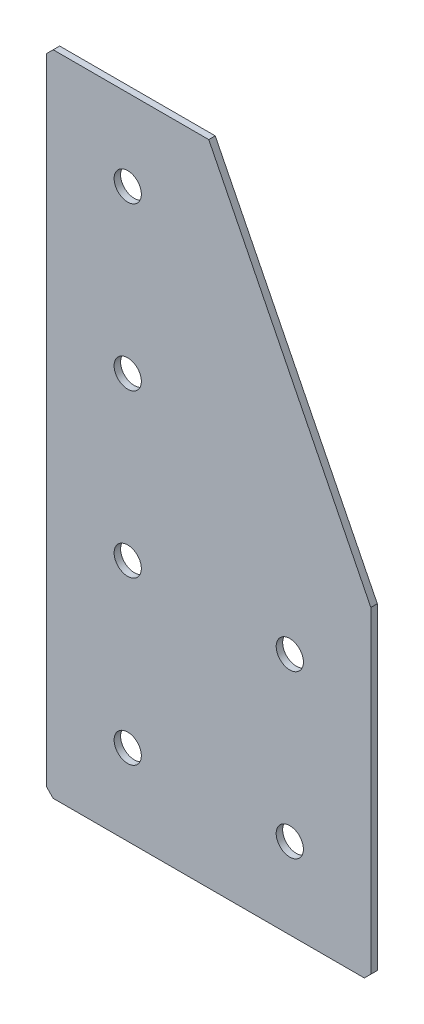
ISO-10303-21;
HEADER;
FILE_DESCRIPTION(('STEP AP214'),'2;1');
FILE_NAME('part.step','',(''),(''),'','','');
FILE_SCHEMA(('AUTOMOTIVE_DESIGN { 1 0 10303 214 1 1 1 1 }'));
ENDSEC;
DATA;
#1=APPLICATION_CONTEXT('core data for automotive mechanical design processes');
#2=APPLICATION_PROTOCOL_DEFINITION('international standard','automotive_design',2000,#1);
#3=PRODUCT_CONTEXT('',#1,'mechanical');
#4=PRODUCT('Part','Part','',(#3));
#5=PRODUCT_RELATED_PRODUCT_CATEGORY('part','',(#4));
#6=PRODUCT_DEFINITION_FORMATION('','',#4);
#7=PRODUCT_DEFINITION_CONTEXT('part definition',#1,'design');
#8=PRODUCT_DEFINITION('design','',#6,#7);
#9=PRODUCT_DEFINITION_SHAPE('','',#8);
#10=(LENGTH_UNIT() NAMED_UNIT(*) SI_UNIT(.MILLI.,.METRE.));
#11=(NAMED_UNIT(*) PLANE_ANGLE_UNIT() SI_UNIT($,.RADIAN.));
#12=(NAMED_UNIT(*) SI_UNIT($,.STERADIAN.) SOLID_ANGLE_UNIT());
#13=UNCERTAINTY_MEASURE_WITH_UNIT(LENGTH_MEASURE(1.E-05),#10,'distance_accuracy_value','');
#14=(GEOMETRIC_REPRESENTATION_CONTEXT(3) GLOBAL_UNCERTAINTY_ASSIGNED_CONTEXT((#13)) GLOBAL_UNIT_ASSIGNED_CONTEXT((#10,
#11,#12)) REPRESENTATION_CONTEXT('',''));
#15=CARTESIAN_POINT('',(0.,0.,0.));
#16=DIRECTION('',(0.,0.,1.));
#17=DIRECTION('',(1.,0.,0.));
#18=AXIS2_PLACEMENT_3D('',#15,#16,#17);
#19=CARTESIAN_POINT('',(0.,0.,-2.));
#20=DIRECTION('',(0.,0.,1.));
#21=DIRECTION('',(1.,0.,0.));
#22=AXIS2_PLACEMENT_3D('',#19,#20,#21);
#23=PLANE('',#22);
#24=CARTESIAN_POINT('',(25.,-175.,-2.00000000000001));
#25=DIRECTION('',(0.,0.,-1.));
#26=DIRECTION('',(0.,1.,0.));
#27=AXIS2_PLACEMENT_3D('',#24,#25,#26);
#28=CIRCLE('',#27,4.2);
#29=CARTESIAN_POINT('',(25.,-170.8,-2.00000000000001));
#30=VERTEX_POINT('',#29);
#31=EDGE_CURVE('E243',#30,#30,#28,.T.);
#32=ORIENTED_EDGE('',*,*,#31,.F.);
#33=EDGE_LOOP('',(#32));
#34=FACE_BOUND('',#33,.T.);
#35=CARTESIAN_POINT('',(25.,-125.,-2.00000000000001));
#36=DIRECTION('',(0.,0.,-1.));
#37=DIRECTION('',(0.,1.,0.));
#38=AXIS2_PLACEMENT_3D('',#35,#36,#37);
#39=CIRCLE('',#38,4.2);
#40=CARTESIAN_POINT('',(25.,-120.8,-2.00000000000001));
#41=VERTEX_POINT('',#40);
#42=EDGE_CURVE('E235',#41,#41,#39,.T.);
#43=ORIENTED_EDGE('',*,*,#42,.F.);
#44=EDGE_LOOP('',(#43));
#45=FACE_BOUND('',#44,.T.);
#46=CARTESIAN_POINT('',(25.,-25.,-2.));
#47=DIRECTION('',(0.,0.,-1.));
#48=DIRECTION('',(0.,1.,0.));
#49=AXIS2_PLACEMENT_3D('',#46,#47,#48);
#50=CIRCLE('',#49,4.2);
#51=CARTESIAN_POINT('',(25.,-20.8,-2.));
#52=VERTEX_POINT('',#51);
#53=EDGE_CURVE('E219',#52,#52,#50,.T.);
#54=ORIENTED_EDGE('',*,*,#53,.F.);
#55=EDGE_LOOP('',(#54));
#56=FACE_BOUND('',#55,.T.);
#57=CARTESIAN_POINT('',(75.,-175.,-2.00000000000001));
#58=DIRECTION('',(0.,0.,-1.));
#59=DIRECTION('',(0.,1.,0.));
#60=AXIS2_PLACEMENT_3D('',#57,#58,#59);
#61=CIRCLE('',#60,4.2);
#62=CARTESIAN_POINT('',(75.,-170.8,-2.00000000000001));
#63=VERTEX_POINT('',#62);
#64=EDGE_CURVE('E211',#63,#63,#61,.T.);
#65=ORIENTED_EDGE('',*,*,#64,.F.);
#66=EDGE_LOOP('',(#65));
#67=FACE_BOUND('',#66,.T.);
#68=CARTESIAN_POINT('',(75.,-125.,-2.00000000000001));
#69=DIRECTION('',(0.,0.,-1.));
#70=DIRECTION('',(0.,1.,0.));
#71=AXIS2_PLACEMENT_3D('',#68,#69,#70);
#72=CIRCLE('',#71,4.2);
#73=CARTESIAN_POINT('',(75.,-120.8,-2.00000000000001));
#74=VERTEX_POINT('',#73);
#75=EDGE_CURVE('E203',#74,#74,#72,.T.);
#76=ORIENTED_EDGE('',*,*,#75,.F.);
#77=EDGE_LOOP('',(#76));
#78=FACE_BOUND('',#77,.T.);
#79=DIRECTION('',(0.,1.,0.));
#80=VECTOR('',#79,1.);
#81=CARTESIAN_POINT('',(0.,0.,-2.));
#82=LINE('',#81,#80);
#83=CARTESIAN_POINT('',(0.,-198.,-2.));
#84=VERTEX_POINT('',#83);
#85=CARTESIAN_POINT('',(0.,-2.,-2.));
#86=VERTEX_POINT('',#85);
#87=EDGE_CURVE('E140',#84,#86,#82,.T.);
#88=ORIENTED_EDGE('',*,*,#87,.T.);
#89=DIRECTION('',(-0.707106781186548,-0.707106781186548,0.));
#90=VECTOR('',#89,1.);
#91=CARTESIAN_POINT('',(2.,0.,-2.));
#92=LINE('',#91,#90);
#93=CARTESIAN_POINT('',(2.,0.,-2.));
#94=VERTEX_POINT('',#93);
#95=EDGE_CURVE('E111',#86,#94,#92,.F.);
#96=ORIENTED_EDGE('',*,*,#95,.T.);
#97=DIRECTION('',(1.,0.,0.));
#98=VECTOR('',#97,1.);
#99=CARTESIAN_POINT('',(50.,0.,-2.));
#100=LINE('',#99,#98);
#101=CARTESIAN_POINT('',(50.,0.,-2.));
#102=VERTEX_POINT('',#101);
#103=EDGE_CURVE('E104',#94,#102,#100,.T.);
#104=ORIENTED_EDGE('',*,*,#103,.T.);
#105=DIRECTION('',(0.447213595499958,-0.894427190999916,0.));
#106=VECTOR('',#105,1.);
#107=CARTESIAN_POINT('',(100.,-100.,-2.));
#108=LINE('',#107,#106);
#109=CARTESIAN_POINT('',(100.,-100.,-2.));
#110=VERTEX_POINT('',#109);
#111=EDGE_CURVE('E108',#102,#110,#108,.T.);
#112=ORIENTED_EDGE('',*,*,#111,.T.);
#113=DIRECTION('',(0.,-1.,0.));
#114=VECTOR('',#113,1.);
#115=CARTESIAN_POINT('',(100.,-200.,-2.));
#116=LINE('',#115,#114);
#117=CARTESIAN_POINT('',(100.,-198.,-2.));
#118=VERTEX_POINT('',#117);
#119=EDGE_CURVE('E127',#110,#118,#116,.T.);
#120=ORIENTED_EDGE('',*,*,#119,.T.);
#121=DIRECTION('',(0.707106781186548,0.707106781186548,0.));
#122=VECTOR('',#121,1.);
#123=CARTESIAN_POINT('',(97.9999999999999,-200.,-2.));
#124=LINE('',#123,#122);
#125=CARTESIAN_POINT('',(97.9999999999999,-200.,-2.));
#126=VERTEX_POINT('',#125);
#127=EDGE_CURVE('E62',#118,#126,#124,.F.);
#128=ORIENTED_EDGE('',*,*,#127,.T.);
#129=DIRECTION('',(-1.,0.,0.));
#130=VECTOR('',#129,1.);
#131=CARTESIAN_POINT('',(0.,-200.,-2.));
#132=LINE('',#131,#130);
#133=CARTESIAN_POINT('',(1.99999999999995,-200.,-2.));
#134=VERTEX_POINT('',#133);
#135=EDGE_CURVE('E173',#126,#134,#132,.T.);
#136=ORIENTED_EDGE('',*,*,#135,.T.);
#137=DIRECTION('',(0.707106781186543,-0.707106781186552,0.));
#138=VECTOR('',#137,1.);
#139=CARTESIAN_POINT('',(0.,-198.,-2.));
#140=LINE('',#139,#138);
#141=EDGE_CURVE('E159',#134,#84,#140,.F.);
#142=ORIENTED_EDGE('',*,*,#141,.T.);
#143=EDGE_LOOP('',(#88,#96,#104,#112,#120,#128,#136,#142));
#144=FACE_BOUND('',#143,.T.);
#145=CARTESIAN_POINT('',(25.,-75.,-2.));
#146=DIRECTION('',(0.,0.,-1.));
#147=DIRECTION('',(0.,1.,0.));
#148=AXIS2_PLACEMENT_3D('',#145,#146,#147);
#149=CIRCLE('',#148,4.2);
#150=CARTESIAN_POINT('',(25.,-70.8,-2.));
#151=VERTEX_POINT('',#150);
#152=EDGE_CURVE('E227',#151,#151,#149,.T.);
#153=ORIENTED_EDGE('',*,*,#152,.F.);
#154=EDGE_LOOP('',(#153));
#155=FACE_BOUND('',#154,.T.);
#156=ADVANCED_FACE('F39',(#34,#45,#56,#67,#78,#144,#155),#23,.F.);
#157=CARTESIAN_POINT('',(50.,0.,-2.));
#158=DIRECTION('',(0.,-1.,0.));
#159=DIRECTION('',(1.,0.,0.));
#160=AXIS2_PLACEMENT_3D('',#157,#158,#159);
#161=PLANE('',#160);
#162=ORIENTED_EDGE('',*,*,#103,.F.);
#163=DIRECTION('',(0.,0.,1.));
#164=VECTOR('',#163,1.);
#165=CARTESIAN_POINT('',(2.,0.,-2.));
#166=LINE('',#165,#164);
#167=CARTESIAN_POINT('',(2.,0.,0.));
#168=VERTEX_POINT('',#167);
#169=EDGE_CURVE('E134',#94,#168,#166,.T.);
#170=ORIENTED_EDGE('',*,*,#169,.T.);
#171=DIRECTION('',(1.,0.,0.));
#172=VECTOR('',#171,1.);
#173=CARTESIAN_POINT('',(50.,0.,0.));
#174=LINE('',#173,#172);
#175=CARTESIAN_POINT('',(50.,0.,0.));
#176=VERTEX_POINT('',#175);
#177=EDGE_CURVE('E131',#168,#176,#174,.T.);
#178=ORIENTED_EDGE('',*,*,#177,.T.);
#179=DIRECTION('',(0.,0.,1.));
#180=VECTOR('',#179,1.);
#181=CARTESIAN_POINT('',(50.,0.,-2.));
#182=LINE('',#181,#180);
#183=EDGE_CURVE('E122',#102,#176,#182,.T.);
#184=ORIENTED_EDGE('',*,*,#183,.F.);
#185=EDGE_LOOP('',(#162,#170,#178,#184));
#186=FACE_BOUND('',#185,.T.);
#187=ADVANCED_FACE('F129',(#186),#161,.F.);
#188=CARTESIAN_POINT('',(100.,-100.,-2.));
#189=DIRECTION('',(-0.894427190999916,-0.447213595499958,0.));
#190=DIRECTION('',(0.447213595499958,-0.894427190999916,0.));
#191=AXIS2_PLACEMENT_3D('',#188,#189,#190);
#192=PLANE('',#191);
#193=DIRECTION('',(0.447213595499958,-0.894427190999916,0.));
#194=VECTOR('',#193,1.);
#195=CARTESIAN_POINT('',(100.,-100.,0.));
#196=LINE('',#195,#194);
#197=CARTESIAN_POINT('',(100.,-100.,0.));
#198=VERTEX_POINT('',#197);
#199=EDGE_CURVE('E186',#176,#198,#196,.T.);
#200=ORIENTED_EDGE('',*,*,#199,.T.);
#201=DIRECTION('',(0.,0.,1.));
#202=VECTOR('',#201,1.);
#203=CARTESIAN_POINT('',(100.,-100.,-2.));
#204=LINE('',#203,#202);
#205=EDGE_CURVE('E124',#110,#198,#204,.T.);
#206=ORIENTED_EDGE('',*,*,#205,.F.);
#207=ORIENTED_EDGE('',*,*,#111,.F.);
#208=ORIENTED_EDGE('',*,*,#183,.T.);
#209=EDGE_LOOP('',(#200,#206,#207,#208));
#210=FACE_BOUND('',#209,.T.);
#211=ADVANCED_FACE('F121',(#210),#192,.F.);
#212=CARTESIAN_POINT('',(100.,-200.,-2.));
#213=DIRECTION('',(-1.,0.,0.));
#214=DIRECTION('',(0.,-1.,0.));
#215=AXIS2_PLACEMENT_3D('',#212,#213,#214);
#216=PLANE('',#215);
#217=DIRECTION('',(0.,-1.,0.));
#218=VECTOR('',#217,1.);
#219=CARTESIAN_POINT('',(100.,-200.,0.));
#220=LINE('',#219,#218);
#221=CARTESIAN_POINT('',(100.,-198.,0.));
#222=VERTEX_POINT('',#221);
#223=EDGE_CURVE('E181',#198,#222,#220,.T.);
#224=ORIENTED_EDGE('',*,*,#223,.T.);
#225=DIRECTION('',(0.,0.,-1.));
#226=VECTOR('',#225,1.);
#227=CARTESIAN_POINT('',(100.,-198.,-2.));
#228=LINE('',#227,#226);
#229=EDGE_CURVE('E11',#222,#118,#228,.T.);
#230=ORIENTED_EDGE('',*,*,#229,.T.);
#231=ORIENTED_EDGE('',*,*,#119,.F.);
#232=ORIENTED_EDGE('',*,*,#205,.T.);
#233=EDGE_LOOP('',(#224,#230,#231,#232));
#234=FACE_BOUND('',#233,.T.);
#235=ADVANCED_FACE('F283',(#234),#216,.F.);
#236=CARTESIAN_POINT('',(0.,-200.,-2.));
#237=DIRECTION('',(0.,1.,0.));
#238=DIRECTION('',(0.,0.,1.));
#239=AXIS2_PLACEMENT_3D('',#236,#237,#238);
#240=PLANE('',#239);
#241=ORIENTED_EDGE('',*,*,#135,.F.);
#242=DIRECTION('',(0.,0.,1.));
#243=VECTOR('',#242,1.);
#244=CARTESIAN_POINT('',(97.9999999999999,-200.,-2.));
#245=LINE('',#244,#243);
#246=CARTESIAN_POINT('',(97.9999999999999,-200.,0.));
#247=VERTEX_POINT('',#246);
#248=EDGE_CURVE('E48',#126,#247,#245,.T.);
#249=ORIENTED_EDGE('',*,*,#248,.T.);
#250=DIRECTION('',(-1.,0.,0.));
#251=VECTOR('',#250,1.);
#252=CARTESIAN_POINT('',(0.,-200.,0.));
#253=LINE('',#252,#251);
#254=CARTESIAN_POINT('',(1.99999999999995,-200.,0.));
#255=VERTEX_POINT('',#254);
#256=EDGE_CURVE('E172',#247,#255,#253,.T.);
#257=ORIENTED_EDGE('',*,*,#256,.T.);
#258=DIRECTION('',(0.,0.,-1.));
#259=VECTOR('',#258,1.);
#260=CARTESIAN_POINT('',(1.99999999999995,-200.,-2.));
#261=LINE('',#260,#259);
#262=EDGE_CURVE('E55',#255,#134,#261,.T.);
#263=ORIENTED_EDGE('',*,*,#262,.T.);
#264=EDGE_LOOP('',(#241,#249,#257,#263));
#265=FACE_BOUND('',#264,.T.);
#266=ADVANCED_FACE('F171',(#265),#240,.F.);
#267=CARTESIAN_POINT('',(0.,0.,-2.));
#268=DIRECTION('',(1.,0.,0.));
#269=DIRECTION('',(0.,0.,-1.));
#270=AXIS2_PLACEMENT_3D('',#267,#268,#269);
#271=PLANE('',#270);
#272=DIRECTION('',(0.,1.,0.));
#273=VECTOR('',#272,1.);
#274=CARTESIAN_POINT('',(0.,0.,0.));
#275=LINE('',#274,#273);
#276=CARTESIAN_POINT('',(0.,-198.,0.));
#277=VERTEX_POINT('',#276);
#278=CARTESIAN_POINT('',(0.,-2.,0.));
#279=VERTEX_POINT('',#278);
#280=EDGE_CURVE('E117',#277,#279,#275,.T.);
#281=ORIENTED_EDGE('',*,*,#280,.T.);
#282=DIRECTION('',(0.,0.,-1.));
#283=VECTOR('',#282,1.);
#284=CARTESIAN_POINT('',(0.,-2.,-2.));
#285=LINE('',#284,#283);
#286=EDGE_CURVE('E156',#279,#86,#285,.T.);
#287=ORIENTED_EDGE('',*,*,#286,.T.);
#288=ORIENTED_EDGE('',*,*,#87,.F.);
#289=DIRECTION('',(0.,0.,1.));
#290=VECTOR('',#289,1.);
#291=CARTESIAN_POINT('',(0.,-198.,-2.));
#292=LINE('',#291,#290);
#293=EDGE_CURVE('E152',#84,#277,#292,.T.);
#294=ORIENTED_EDGE('',*,*,#293,.T.);
#295=EDGE_LOOP('',(#281,#287,#288,#294));
#296=FACE_BOUND('',#295,.T.);
#297=ADVANCED_FACE('F270',(#296),#271,.F.);
#298=CARTESIAN_POINT('',(0.,0.,0.));
#299=DIRECTION('',(0.,0.,1.));
#300=DIRECTION('',(1.,0.,0.));
#301=AXIS2_PLACEMENT_3D('',#298,#299,#300);
#302=PLANE('',#301);
#303=CARTESIAN_POINT('',(25.,-175.,0.));
#304=DIRECTION('',(0.,0.,1.));
#305=DIRECTION('',(1.,0.,0.));
#306=AXIS2_PLACEMENT_3D('',#303,#304,#305);
#307=CIRCLE('',#306,4.2);
#308=CARTESIAN_POINT('',(29.2,-175.,0.));
#309=VERTEX_POINT('',#308);
#310=EDGE_CURVE('E239',#309,#309,#307,.T.);
#311=ORIENTED_EDGE('',*,*,#310,.F.);
#312=EDGE_LOOP('',(#311));
#313=FACE_BOUND('',#312,.T.);
#314=CARTESIAN_POINT('',(25.,-125.,0.));
#315=DIRECTION('',(0.,0.,1.));
#316=DIRECTION('',(1.,0.,0.));
#317=AXIS2_PLACEMENT_3D('',#314,#315,#316);
#318=CIRCLE('',#317,4.2);
#319=CARTESIAN_POINT('',(29.2,-125.,0.));
#320=VERTEX_POINT('',#319);
#321=EDGE_CURVE('E231',#320,#320,#318,.T.);
#322=ORIENTED_EDGE('',*,*,#321,.F.);
#323=EDGE_LOOP('',(#322));
#324=FACE_BOUND('',#323,.T.);
#325=CARTESIAN_POINT('',(25.,-75.,0.));
#326=DIRECTION('',(0.,0.,1.));
#327=DIRECTION('',(1.,0.,0.));
#328=AXIS2_PLACEMENT_3D('',#325,#326,#327);
#329=CIRCLE('',#328,4.2);
#330=CARTESIAN_POINT('',(29.2,-75.,0.));
#331=VERTEX_POINT('',#330);
#332=EDGE_CURVE('E223',#331,#331,#329,.T.);
#333=ORIENTED_EDGE('',*,*,#332,.F.);
#334=EDGE_LOOP('',(#333));
#335=FACE_BOUND('',#334,.T.);
#336=CARTESIAN_POINT('',(25.,-25.,0.));
#337=DIRECTION('',(0.,0.,1.));
#338=DIRECTION('',(1.,0.,0.));
#339=AXIS2_PLACEMENT_3D('',#336,#337,#338);
#340=CIRCLE('',#339,4.2);
#341=CARTESIAN_POINT('',(29.2,-25.,0.));
#342=VERTEX_POINT('',#341);
#343=EDGE_CURVE('E215',#342,#342,#340,.T.);
#344=ORIENTED_EDGE('',*,*,#343,.F.);
#345=EDGE_LOOP('',(#344));
#346=FACE_BOUND('',#345,.T.);
#347=CARTESIAN_POINT('',(75.,-175.,0.));
#348=DIRECTION('',(0.,0.,1.));
#349=DIRECTION('',(1.,0.,0.));
#350=AXIS2_PLACEMENT_3D('',#347,#348,#349);
#351=CIRCLE('',#350,4.2);
#352=CARTESIAN_POINT('',(79.2,-175.,0.));
#353=VERTEX_POINT('',#352);
#354=EDGE_CURVE('E207',#353,#353,#351,.T.);
#355=ORIENTED_EDGE('',*,*,#354,.F.);
#356=EDGE_LOOP('',(#355));
#357=FACE_BOUND('',#356,.T.);
#358=CARTESIAN_POINT('',(75.,-125.,0.));
#359=DIRECTION('',(0.,0.,1.));
#360=DIRECTION('',(1.,0.,0.));
#361=AXIS2_PLACEMENT_3D('',#358,#359,#360);
#362=CIRCLE('',#361,4.2);
#363=CARTESIAN_POINT('',(79.2,-125.,0.));
#364=VERTEX_POINT('',#363);
#365=EDGE_CURVE('E193',#364,#364,#362,.T.);
#366=ORIENTED_EDGE('',*,*,#365,.F.);
#367=EDGE_LOOP('',(#366));
#368=FACE_BOUND('',#367,.T.);
#369=ORIENTED_EDGE('',*,*,#177,.F.);
#370=DIRECTION('',(0.707106781186548,0.707106781186548,0.));
#371=VECTOR('',#370,1.);
#372=CARTESIAN_POINT('',(1.,-1.,0.));
#373=LINE('',#372,#371);
#374=EDGE_CURVE('E149',#168,#279,#373,.F.);
#375=ORIENTED_EDGE('',*,*,#374,.T.);
#376=ORIENTED_EDGE('',*,*,#280,.F.);
#377=DIRECTION('',(-0.707106781186543,0.707106781186552,0.));
#378=VECTOR('',#377,1.);
#379=CARTESIAN_POINT('',(-99.,-98.9999999999986,0.));
#380=LINE('',#379,#378);
#381=EDGE_CURVE('E138',#277,#255,#380,.F.);
#382=ORIENTED_EDGE('',*,*,#381,.T.);
#383=ORIENTED_EDGE('',*,*,#256,.F.);
#384=DIRECTION('',(-0.707106781186548,-0.707106781186548,0.));
#385=VECTOR('',#384,1.);
#386=CARTESIAN_POINT('',(149.,-149.,0.));
#387=LINE('',#386,#385);
#388=EDGE_CURVE('E146',#247,#222,#387,.F.);
#389=ORIENTED_EDGE('',*,*,#388,.T.);
#390=ORIENTED_EDGE('',*,*,#223,.F.);
#391=ORIENTED_EDGE('',*,*,#199,.F.);
#392=EDGE_LOOP('',(#369,#375,#376,#382,#383,#389,#390,#391));
#393=FACE_BOUND('',#392,.T.);
#394=ADVANCED_FACE('F176',(#313,#324,#335,#346,#357,#368,#393),#302,.T.);
#395=CARTESIAN_POINT('',(75.,-125.,-2.00000000000001));
#396=DIRECTION('',(0.,0.,-1.));
#397=DIRECTION('',(0.,1.,0.));
#398=AXIS2_PLACEMENT_3D('',#395,#396,#397);
#399=CYLINDRICAL_SURFACE('',#398,4.2);
#400=ORIENTED_EDGE('',*,*,#75,.T.);
#401=EDGE_LOOP('',(#400));
#402=FACE_BOUND('',#401,.T.);
#403=ORIENTED_EDGE('',*,*,#365,.T.);
#404=EDGE_LOOP('',(#403));
#405=FACE_BOUND('',#404,.T.);
#406=ADVANCED_FACE('F262',(#402,#405),#399,.F.);
#407=CARTESIAN_POINT('',(75.,-175.,-2.00000000000001));
#408=DIRECTION('',(0.,0.,-1.));
#409=DIRECTION('',(0.,1.,0.));
#410=AXIS2_PLACEMENT_3D('',#407,#408,#409);
#411=CYLINDRICAL_SURFACE('',#410,4.2);
#412=ORIENTED_EDGE('',*,*,#64,.T.);
#413=EDGE_LOOP('',(#412));
#414=FACE_BOUND('',#413,.T.);
#415=ORIENTED_EDGE('',*,*,#354,.T.);
#416=EDGE_LOOP('',(#415));
#417=FACE_BOUND('',#416,.T.);
#418=ADVANCED_FACE('F265',(#414,#417),#411,.F.);
#419=CARTESIAN_POINT('',(25.,-25.,-2.));
#420=DIRECTION('',(0.,0.,-1.));
#421=DIRECTION('',(0.,1.,0.));
#422=AXIS2_PLACEMENT_3D('',#419,#420,#421);
#423=CYLINDRICAL_SURFACE('',#422,4.2);
#424=ORIENTED_EDGE('',*,*,#53,.T.);
#425=EDGE_LOOP('',(#424));
#426=FACE_BOUND('',#425,.T.);
#427=ORIENTED_EDGE('',*,*,#343,.T.);
#428=EDGE_LOOP('',(#427));
#429=FACE_BOUND('',#428,.T.);
#430=ADVANCED_FACE('F381',(#426,#429),#423,.F.);
#431=CARTESIAN_POINT('',(25.,-75.,-2.));
#432=DIRECTION('',(0.,0.,-1.));
#433=DIRECTION('',(0.,1.,0.));
#434=AXIS2_PLACEMENT_3D('',#431,#432,#433);
#435=CYLINDRICAL_SURFACE('',#434,4.2);
#436=ORIENTED_EDGE('',*,*,#152,.T.);
#437=EDGE_LOOP('',(#436));
#438=FACE_BOUND('',#437,.T.);
#439=ORIENTED_EDGE('',*,*,#332,.T.);
#440=EDGE_LOOP('',(#439));
#441=FACE_BOUND('',#440,.T.);
#442=ADVANCED_FACE('F371',(#438,#441),#435,.F.);
#443=CARTESIAN_POINT('',(25.,-125.,-2.00000000000001));
#444=DIRECTION('',(0.,0.,-1.));
#445=DIRECTION('',(0.,1.,0.));
#446=AXIS2_PLACEMENT_3D('',#443,#444,#445);
#447=CYLINDRICAL_SURFACE('',#446,4.2);
#448=ORIENTED_EDGE('',*,*,#42,.T.);
#449=EDGE_LOOP('',(#448));
#450=FACE_BOUND('',#449,.T.);
#451=ORIENTED_EDGE('',*,*,#321,.T.);
#452=EDGE_LOOP('',(#451));
#453=FACE_BOUND('',#452,.T.);
#454=ADVANCED_FACE('F362',(#450,#453),#447,.F.);
#455=CARTESIAN_POINT('',(25.,-175.,-2.00000000000001));
#456=DIRECTION('',(0.,0.,-1.));
#457=DIRECTION('',(0.,1.,0.));
#458=AXIS2_PLACEMENT_3D('',#455,#456,#457);
#459=CYLINDRICAL_SURFACE('',#458,4.2);
#460=ORIENTED_EDGE('',*,*,#31,.T.);
#461=EDGE_LOOP('',(#460));
#462=FACE_BOUND('',#461,.T.);
#463=ORIENTED_EDGE('',*,*,#310,.T.);
#464=EDGE_LOOP('',(#463));
#465=FACE_BOUND('',#464,.T.);
#466=ADVANCED_FACE('F248',(#462,#465),#459,.F.);
#467=CARTESIAN_POINT('',(2.,0.,-2.));
#468=DIRECTION('',(0.707106781186547,-0.707106781186547,0.));
#469=DIRECTION('',(0.,0.,1.));
#470=AXIS2_PLACEMENT_3D('',#467,#468,#469);
#471=PLANE('',#470);
#472=ORIENTED_EDGE('',*,*,#95,.F.);
#473=ORIENTED_EDGE('',*,*,#286,.F.);
#474=ORIENTED_EDGE('',*,*,#374,.F.);
#475=ORIENTED_EDGE('',*,*,#169,.F.);
#476=EDGE_LOOP('',(#472,#473,#474,#475));
#477=FACE_BOUND('',#476,.T.);
#478=ADVANCED_FACE('F291',(#477),#471,.F.);
#479=CARTESIAN_POINT('',(97.9999999999999,-200.,-2.));
#480=DIRECTION('',(-0.707106781186547,0.707106781186547,0.));
#481=DIRECTION('',(0.,0.,1.));
#482=AXIS2_PLACEMENT_3D('',#479,#480,#481);
#483=PLANE('',#482);
#484=ORIENTED_EDGE('',*,*,#127,.F.);
#485=ORIENTED_EDGE('',*,*,#229,.F.);
#486=ORIENTED_EDGE('',*,*,#388,.F.);
#487=ORIENTED_EDGE('',*,*,#248,.F.);
#488=EDGE_LOOP('',(#484,#485,#486,#487));
#489=FACE_BOUND('',#488,.T.);
#490=ADVANCED_FACE('F293',(#489),#483,.F.);
#491=CARTESIAN_POINT('',(0.,-198.,-2.));
#492=DIRECTION('',(0.707106781186552,0.707106781186543,0.));
#493=DIRECTION('',(0.,0.,1.));
#494=AXIS2_PLACEMENT_3D('',#491,#492,#493);
#495=PLANE('',#494);
#496=ORIENTED_EDGE('',*,*,#141,.F.);
#497=ORIENTED_EDGE('',*,*,#262,.F.);
#498=ORIENTED_EDGE('',*,*,#381,.F.);
#499=ORIENTED_EDGE('',*,*,#293,.F.);
#500=EDGE_LOOP('',(#496,#497,#498,#499));
#501=FACE_BOUND('',#500,.T.);
#502=ADVANCED_FACE('F41',(#501),#495,.F.);
#503=CLOSED_SHELL('',(#156,#187,#211,#235,#266,#297,#394,#406,#418,#430,#442,#454,#466,#478,
#490,#502));
#504=MANIFOLD_SOLID_BREP('B2',#503);
#505=ADVANCED_BREP_SHAPE_REPRESENTATION('',(#18,#504),#14);
#506=SHAPE_DEFINITION_REPRESENTATION(#9,#505);
ENDSEC;
END-ISO-10303-21;
